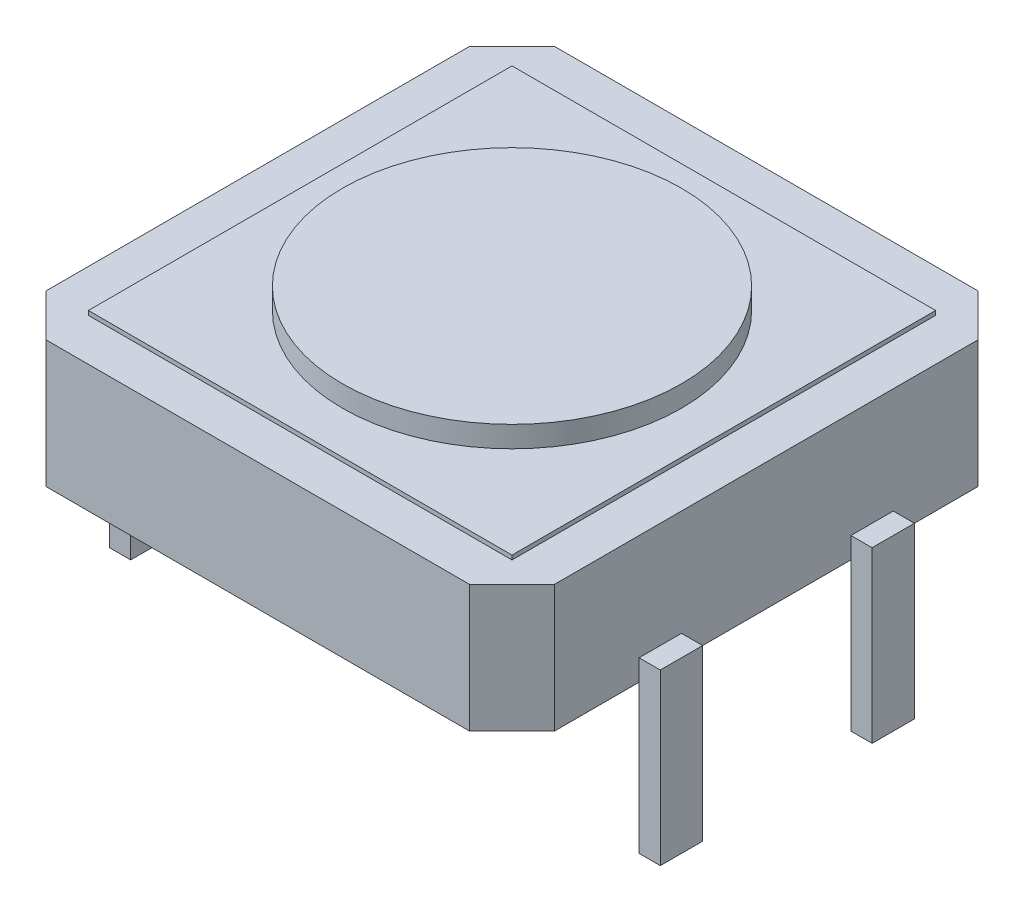
ISO-10303-21;
HEADER;
FILE_DESCRIPTION(('STEP AP214'),'2;1');
FILE_NAME('part.step','',(''),(''),'','','');
FILE_SCHEMA(('AUTOMOTIVE_DESIGN { 1 0 10303 214 1 1 1 1 }'));
ENDSEC;
DATA;
#1=APPLICATION_CONTEXT('core data for automotive mechanical design processes');
#2=APPLICATION_PROTOCOL_DEFINITION('international standard','automotive_design',2000,#1);
#3=PRODUCT_CONTEXT('',#1,'mechanical');
#4=PRODUCT('Part','Part','',(#3));
#5=PRODUCT_RELATED_PRODUCT_CATEGORY('part','',(#4));
#6=PRODUCT_DEFINITION_FORMATION('','',#4);
#7=PRODUCT_DEFINITION_CONTEXT('part definition',#1,'design');
#8=PRODUCT_DEFINITION('design','',#6,#7);
#9=PRODUCT_DEFINITION_SHAPE('','',#8);
#10=(LENGTH_UNIT() NAMED_UNIT(*) SI_UNIT(.MILLI.,.METRE.));
#11=(NAMED_UNIT(*) PLANE_ANGLE_UNIT() SI_UNIT($,.RADIAN.));
#12=(NAMED_UNIT(*) SI_UNIT($,.STERADIAN.) SOLID_ANGLE_UNIT());
#13=UNCERTAINTY_MEASURE_WITH_UNIT(LENGTH_MEASURE(1.E-05),#10,'distance_accuracy_value','');
#14=(GEOMETRIC_REPRESENTATION_CONTEXT(3) GLOBAL_UNCERTAINTY_ASSIGNED_CONTEXT((#13)) GLOBAL_UNIT_ASSIGNED_CONTEXT((#10,
#11,#12)) REPRESENTATION_CONTEXT('',''));
#15=CARTESIAN_POINT('',(0.,0.,0.));
#16=DIRECTION('',(0.,0.,1.));
#17=DIRECTION('',(1.,0.,0.));
#18=AXIS2_PLACEMENT_3D('',#15,#16,#17);
#19=CARTESIAN_POINT('',(12.,3.,-1.));
#20=DIRECTION('',(-1.,0.,0.));
#21=DIRECTION('',(0.,0.,1.));
#22=AXIS2_PLACEMENT_3D('',#19,#20,#21);
#23=PLANE('',#22);
#24=DIRECTION('',(0.,-1.,0.));
#25=VECTOR('',#24,1.);
#26=CARTESIAN_POINT('',(12.,0.5,-3.));
#27=LINE('',#26,#25);
#28=CARTESIAN_POINT('',(12.,0.5,-3.));
#29=VERTEX_POINT('',#28);
#30=CARTESIAN_POINT('',(12.,0.,-3.));
#31=VERTEX_POINT('',#30);
#32=EDGE_CURVE('E53',#29,#31,#27,.T.);
#33=ORIENTED_EDGE('',*,*,#32,.F.);
#34=DIRECTION('',(0.,0.,1.));
#35=VECTOR('',#34,1.);
#36=CARTESIAN_POINT('',(12.,0.5,-3.));
#37=LINE('',#36,#35);
#38=CARTESIAN_POINT('',(12.,0.5,-4.));
#39=VERTEX_POINT('',#38);
#40=EDGE_CURVE('E57',#39,#29,#37,.T.);
#41=ORIENTED_EDGE('',*,*,#40,.F.);
#42=DIRECTION('',(0.,1.,0.));
#43=VECTOR('',#42,1.);
#44=CARTESIAN_POINT('',(12.,0.5,-4.));
#45=LINE('',#44,#43);
#46=CARTESIAN_POINT('',(12.,0.,-4.));
#47=VERTEX_POINT('',#46);
#48=EDGE_CURVE('E939',#47,#39,#45,.T.);
#49=ORIENTED_EDGE('',*,*,#48,.F.);
#50=DIRECTION('',(0.,0.,-1.));
#51=VECTOR('',#50,1.);
#52=CARTESIAN_POINT('',(12.,0.,-1.));
#53=LINE('',#52,#51);
#54=CARTESIAN_POINT('',(12.,0.,-8.));
#55=VERTEX_POINT('',#54);
#56=EDGE_CURVE('E445',#47,#55,#53,.T.);
#57=ORIENTED_EDGE('',*,*,#56,.T.);
#58=DIRECTION('',(0.,-1.,0.));
#59=VECTOR('',#58,1.);
#60=CARTESIAN_POINT('',(12.,0.5,-8.));
#61=LINE('',#60,#59);
#62=CARTESIAN_POINT('',(12.,0.5,-8.));
#63=VERTEX_POINT('',#62);
#64=EDGE_CURVE('E322',#63,#55,#61,.T.);
#65=ORIENTED_EDGE('',*,*,#64,.F.);
#66=DIRECTION('',(0.,0.,1.));
#67=VECTOR('',#66,1.);
#68=CARTESIAN_POINT('',(12.,0.5,-8.));
#69=LINE('',#68,#67);
#70=CARTESIAN_POINT('',(12.,0.5,-9.));
#71=VERTEX_POINT('',#70);
#72=EDGE_CURVE('E315',#71,#63,#69,.T.);
#73=ORIENTED_EDGE('',*,*,#72,.F.);
#74=DIRECTION('',(0.,1.,0.));
#75=VECTOR('',#74,1.);
#76=CARTESIAN_POINT('',(12.,0.5,-9.));
#77=LINE('',#76,#75);
#78=CARTESIAN_POINT('',(12.,0.,-9.));
#79=VERTEX_POINT('',#78);
#80=EDGE_CURVE('E11',#79,#71,#77,.T.);
#81=ORIENTED_EDGE('',*,*,#80,.F.);
#82=CARTESIAN_POINT('',(12.,0.,-11.));
#83=VERTEX_POINT('',#82);
#84=EDGE_CURVE('E440',#79,#83,#53,.T.);
#85=ORIENTED_EDGE('',*,*,#84,.T.);
#86=DIRECTION('',(0.,-1.,0.));
#87=VECTOR('',#86,1.);
#88=CARTESIAN_POINT('',(12.,3.,-11.));
#89=LINE('',#88,#87);
#90=CARTESIAN_POINT('',(12.,3.,-11.));
#91=VERTEX_POINT('',#90);
#92=EDGE_CURVE('E459',#91,#83,#89,.T.);
#93=ORIENTED_EDGE('',*,*,#92,.F.);
#94=DIRECTION('',(0.,0.,-1.));
#95=VECTOR('',#94,1.);
#96=CARTESIAN_POINT('',(12.,3.,-1.));
#97=LINE('',#96,#95);
#98=CARTESIAN_POINT('',(12.,3.,-1.));
#99=VERTEX_POINT('',#98);
#100=EDGE_CURVE('E421',#99,#91,#97,.T.);
#101=ORIENTED_EDGE('',*,*,#100,.F.);
#102=DIRECTION('',(0.,-1.,0.));
#103=VECTOR('',#102,1.);
#104=CARTESIAN_POINT('',(12.,3.,-1.));
#105=LINE('',#104,#103);
#106=CARTESIAN_POINT('',(12.,0.,-1.));
#107=VERTEX_POINT('',#106);
#108=EDGE_CURVE('E462',#99,#107,#105,.T.);
#109=ORIENTED_EDGE('',*,*,#108,.T.);
#110=EDGE_CURVE('E441',#107,#31,#53,.T.);
#111=ORIENTED_EDGE('',*,*,#110,.T.);
#112=EDGE_LOOP('',(#33,#41,#49,#57,#65,#73,#81,#85,#93,#101,#109,#111));
#113=FACE_BOUND('',#112,.T.);
#114=ADVANCED_FACE('F35',(#113),#23,.F.);
#115=CARTESIAN_POINT('',(0.,3.,-1.));
#116=DIRECTION('',(1.,0.,0.));
#117=DIRECTION('',(0.,0.,-1.));
#118=AXIS2_PLACEMENT_3D('',#115,#116,#117);
#119=PLANE('',#118);
#120=DIRECTION('',(0.,-1.,0.));
#121=VECTOR('',#120,1.);
#122=CARTESIAN_POINT('',(0.,0.5,-4.));
#123=LINE('',#122,#121);
#124=CARTESIAN_POINT('',(0.,0.5,-4.));
#125=VERTEX_POINT('',#124);
#126=CARTESIAN_POINT('',(0.,0.,-4.));
#127=VERTEX_POINT('',#126);
#128=EDGE_CURVE('E273',#125,#127,#123,.T.);
#129=ORIENTED_EDGE('',*,*,#128,.F.);
#130=DIRECTION('',(0.,0.,-1.));
#131=VECTOR('',#130,1.);
#132=CARTESIAN_POINT('',(0.,0.5,-4.));
#133=LINE('',#132,#131);
#134=CARTESIAN_POINT('',(0.,0.5,-3.));
#135=VERTEX_POINT('',#134);
#136=EDGE_CURVE('E283',#135,#125,#133,.T.);
#137=ORIENTED_EDGE('',*,*,#136,.F.);
#138=DIRECTION('',(0.,1.,0.));
#139=VECTOR('',#138,1.);
#140=CARTESIAN_POINT('',(0.,0.5,-3.));
#141=LINE('',#140,#139);
#142=CARTESIAN_POINT('',(0.,0.,-3.));
#143=VERTEX_POINT('',#142);
#144=EDGE_CURVE('E293',#143,#135,#141,.T.);
#145=ORIENTED_EDGE('',*,*,#144,.F.);
#146=DIRECTION('',(0.,0.,1.));
#147=VECTOR('',#146,1.);
#148=CARTESIAN_POINT('',(0.,0.,-1.));
#149=LINE('',#148,#147);
#150=CARTESIAN_POINT('',(0.,0.,-1.));
#151=VERTEX_POINT('',#150);
#152=EDGE_CURVE('E410',#143,#151,#149,.T.);
#153=ORIENTED_EDGE('',*,*,#152,.T.);
#154=DIRECTION('',(0.,-1.,0.));
#155=VECTOR('',#154,1.);
#156=CARTESIAN_POINT('',(0.,3.,-1.));
#157=LINE('',#156,#155);
#158=CARTESIAN_POINT('',(0.,3.,-1.));
#159=VERTEX_POINT('',#158);
#160=EDGE_CURVE('E470',#159,#151,#157,.T.);
#161=ORIENTED_EDGE('',*,*,#160,.F.);
#162=DIRECTION('',(0.,0.,1.));
#163=VECTOR('',#162,1.);
#164=CARTESIAN_POINT('',(0.,3.,-1.));
#165=LINE('',#164,#163);
#166=CARTESIAN_POINT('',(0.,3.,-11.));
#167=VERTEX_POINT('',#166);
#168=EDGE_CURVE('E411',#167,#159,#165,.T.);
#169=ORIENTED_EDGE('',*,*,#168,.F.);
#170=DIRECTION('',(0.,-1.,0.));
#171=VECTOR('',#170,1.);
#172=CARTESIAN_POINT('',(0.,3.,-11.));
#173=LINE('',#172,#171);
#174=CARTESIAN_POINT('',(0.,0.,-11.));
#175=VERTEX_POINT('',#174);
#176=EDGE_CURVE('E429',#167,#175,#173,.T.);
#177=ORIENTED_EDGE('',*,*,#176,.T.);
#178=CARTESIAN_POINT('',(0.,0.,-9.));
#179=VERTEX_POINT('',#178);
#180=EDGE_CURVE('E430',#175,#179,#149,.T.);
#181=ORIENTED_EDGE('',*,*,#180,.T.);
#182=DIRECTION('',(0.,-1.,0.));
#183=VECTOR('',#182,1.);
#184=CARTESIAN_POINT('',(0.,0.5,-9.));
#185=LINE('',#184,#183);
#186=CARTESIAN_POINT('',(0.,0.5,-9.));
#187=VERTEX_POINT('',#186);
#188=EDGE_CURVE('E353',#187,#179,#185,.T.);
#189=ORIENTED_EDGE('',*,*,#188,.F.);
#190=DIRECTION('',(0.,0.,-1.));
#191=VECTOR('',#190,1.);
#192=CARTESIAN_POINT('',(0.,0.5,-9.));
#193=LINE('',#192,#191);
#194=CARTESIAN_POINT('',(0.,0.5,-8.));
#195=VERTEX_POINT('',#194);
#196=EDGE_CURVE('E346',#195,#187,#193,.T.);
#197=ORIENTED_EDGE('',*,*,#196,.F.);
#198=DIRECTION('',(0.,1.,0.));
#199=VECTOR('',#198,1.);
#200=CARTESIAN_POINT('',(0.,0.5,-8.));
#201=LINE('',#200,#199);
#202=CARTESIAN_POINT('',(0.,0.,-8.));
#203=VERTEX_POINT('',#202);
#204=EDGE_CURVE('E44',#203,#195,#201,.T.);
#205=ORIENTED_EDGE('',*,*,#204,.F.);
#206=EDGE_CURVE('E503',#203,#127,#149,.T.);
#207=ORIENTED_EDGE('',*,*,#206,.T.);
#208=EDGE_LOOP('',(#129,#137,#145,#153,#161,#169,#177,#181,#189,#197,#205,#207));
#209=FACE_BOUND('',#208,.T.);
#210=ADVANCED_FACE('F37',(#209),#119,.F.);
#211=CARTESIAN_POINT('',(0.,3.1,0.));
#212=DIRECTION('',(0.,-1.,0.));
#213=DIRECTION('',(0.,0.,-1.));
#214=AXIS2_PLACEMENT_3D('',#211,#212,#213);
#215=PLANE('',#214);
#216=DIRECTION('',(0.,0.,1.));
#217=VECTOR('',#216,1.);
#218=CARTESIAN_POINT('',(1.,3.1,-1.));
#219=LINE('',#218,#217);
#220=CARTESIAN_POINT('',(1.,3.1,-11.));
#221=VERTEX_POINT('',#220);
#222=CARTESIAN_POINT('',(1.,3.1,-1.));
#223=VERTEX_POINT('',#222);
#224=EDGE_CURVE('E378',#221,#223,#219,.T.);
#225=ORIENTED_EDGE('',*,*,#224,.T.);
#226=DIRECTION('',(1.,0.,0.));
#227=VECTOR('',#226,1.);
#228=CARTESIAN_POINT('',(1.,3.1,-1.));
#229=LINE('',#228,#227);
#230=CARTESIAN_POINT('',(11.,3.1,-1.));
#231=VERTEX_POINT('',#230);
#232=EDGE_CURVE('E381',#223,#231,#229,.T.);
#233=ORIENTED_EDGE('',*,*,#232,.T.);
#234=DIRECTION('',(0.,0.,-1.));
#235=VECTOR('',#234,1.);
#236=CARTESIAN_POINT('',(11.,3.1,-1.));
#237=LINE('',#236,#235);
#238=CARTESIAN_POINT('',(11.,3.1,-11.));
#239=VERTEX_POINT('',#238);
#240=EDGE_CURVE('E384',#231,#239,#237,.T.);
#241=ORIENTED_EDGE('',*,*,#240,.T.);
#242=DIRECTION('',(-1.,0.,0.));
#243=VECTOR('',#242,1.);
#244=CARTESIAN_POINT('',(1.,3.1,-11.));
#245=LINE('',#244,#243);
#246=EDGE_CURVE('E386',#239,#221,#245,.T.);
#247=ORIENTED_EDGE('',*,*,#246,.T.);
#248=EDGE_LOOP('',(#225,#233,#241,#247));
#249=FACE_BOUND('',#248,.T.);
#250=CARTESIAN_POINT('',(6.,3.1,-6.));
#251=DIRECTION('',(0.,-1.,0.));
#252=DIRECTION('',(0.,0.,-1.));
#253=AXIS2_PLACEMENT_3D('',#250,#251,#252);
#254=CIRCLE('',#253,4.);
#255=CARTESIAN_POINT('',(6.,3.1,-10.));
#256=VERTEX_POINT('',#255);
#257=EDGE_CURVE('E39',#256,#256,#254,.F.);
#258=ORIENTED_EDGE('',*,*,#257,.F.);
#259=EDGE_LOOP('',(#258));
#260=FACE_BOUND('',#259,.T.);
#261=ADVANCED_FACE('F585',(#249,#260),#215,.F.);
#262=CARTESIAN_POINT('',(0.,3.,0.));
#263=DIRECTION('',(0.,-1.,0.));
#264=DIRECTION('',(0.,0.,-1.));
#265=AXIS2_PLACEMENT_3D('',#262,#263,#264);
#266=PLANE('',#265);
#267=ORIENTED_EDGE('',*,*,#168,.T.);
#268=DIRECTION('',(0.707106781186548,0.,0.707106781186548));
#269=VECTOR('',#268,1.);
#270=CARTESIAN_POINT('',(0.,3.,-1.));
#271=LINE('',#270,#269);
#272=CARTESIAN_POINT('',(1.,3.,0.));
#273=VERTEX_POINT('',#272);
#274=EDGE_CURVE('E414',#159,#273,#271,.T.);
#275=ORIENTED_EDGE('',*,*,#274,.T.);
#276=DIRECTION('',(1.,0.,0.));
#277=VECTOR('',#276,1.);
#278=CARTESIAN_POINT('',(1.,3.,0.));
#279=LINE('',#278,#277);
#280=CARTESIAN_POINT('',(11.,3.,0.));
#281=VERTEX_POINT('',#280);
#282=EDGE_CURVE('E417',#273,#281,#279,.T.);
#283=ORIENTED_EDGE('',*,*,#282,.T.);
#284=DIRECTION('',(0.707106781186548,0.,-0.707106781186547));
#285=VECTOR('',#284,1.);
#286=CARTESIAN_POINT('',(11.,3.,0.));
#287=LINE('',#286,#285);
#288=EDGE_CURVE('E419',#281,#99,#287,.T.);
#289=ORIENTED_EDGE('',*,*,#288,.T.);
#290=ORIENTED_EDGE('',*,*,#100,.T.);
#291=DIRECTION('',(-0.707106781186547,0.,-0.707106781186547));
#292=VECTOR('',#291,1.);
#293=CARTESIAN_POINT('',(11.,3.,-12.));
#294=LINE('',#293,#292);
#295=CARTESIAN_POINT('',(11.,3.,-12.));
#296=VERTEX_POINT('',#295);
#297=EDGE_CURVE('E423',#91,#296,#294,.T.);
#298=ORIENTED_EDGE('',*,*,#297,.T.);
#299=DIRECTION('',(-1.,0.,0.));
#300=VECTOR('',#299,1.);
#301=CARTESIAN_POINT('',(1.,3.,-12.));
#302=LINE('',#301,#300);
#303=CARTESIAN_POINT('',(1.,3.,-12.));
#304=VERTEX_POINT('',#303);
#305=EDGE_CURVE('E425',#296,#304,#302,.T.);
#306=ORIENTED_EDGE('',*,*,#305,.T.);
#307=DIRECTION('',(-0.707106781186547,0.,0.707106781186548));
#308=VECTOR('',#307,1.);
#309=CARTESIAN_POINT('',(0.,3.,-11.));
#310=LINE('',#309,#308);
#311=EDGE_CURVE('E427',#304,#167,#310,.T.);
#312=ORIENTED_EDGE('',*,*,#311,.T.);
#313=EDGE_LOOP('',(#267,#275,#283,#289,#290,#298,#306,#312));
#314=FACE_BOUND('',#313,.T.);
#315=DIRECTION('',(0.,0.,1.));
#316=VECTOR('',#315,1.);
#317=CARTESIAN_POINT('',(1.,3.,-1.));
#318=LINE('',#317,#316);
#319=CARTESIAN_POINT('',(1.,3.,-11.));
#320=VERTEX_POINT('',#319);
#321=CARTESIAN_POINT('',(1.,3.,-1.));
#322=VERTEX_POINT('',#321);
#323=EDGE_CURVE('E377',#320,#322,#318,.T.);
#324=ORIENTED_EDGE('',*,*,#323,.F.);
#325=DIRECTION('',(-1.,0.,0.));
#326=VECTOR('',#325,1.);
#327=CARTESIAN_POINT('',(1.,3.,-11.));
#328=LINE('',#327,#326);
#329=CARTESIAN_POINT('',(11.,3.,-11.));
#330=VERTEX_POINT('',#329);
#331=EDGE_CURVE('E382',#330,#320,#328,.T.);
#332=ORIENTED_EDGE('',*,*,#331,.F.);
#333=DIRECTION('',(0.,0.,-1.));
#334=VECTOR('',#333,1.);
#335=CARTESIAN_POINT('',(11.,3.,-1.));
#336=LINE('',#335,#334);
#337=CARTESIAN_POINT('',(11.,3.,-1.));
#338=VERTEX_POINT('',#337);
#339=EDGE_CURVE('E394',#338,#330,#336,.T.);
#340=ORIENTED_EDGE('',*,*,#339,.F.);
#341=DIRECTION('',(1.,0.,0.));
#342=VECTOR('',#341,1.);
#343=CARTESIAN_POINT('',(1.,3.,-1.));
#344=LINE('',#343,#342);
#345=EDGE_CURVE('E391',#322,#338,#344,.T.);
#346=ORIENTED_EDGE('',*,*,#345,.F.);
#347=EDGE_LOOP('',(#324,#332,#340,#346));
#348=FACE_BOUND('',#347,.T.);
#349=ADVANCED_FACE('F524',(#314,#348),#266,.F.);
#350=CARTESIAN_POINT('',(0.,3.,-1.));
#351=DIRECTION('',(0.707106781186547,0.,-0.707106781186547));
#352=DIRECTION('',(-0.707106781186548,0.,-0.707106781186548));
#353=AXIS2_PLACEMENT_3D('',#350,#351,#352);
#354=PLANE('',#353);
#355=DIRECTION('',(0.707106781186548,0.,0.707106781186548));
#356=VECTOR('',#355,1.);
#357=CARTESIAN_POINT('',(0.,0.,-1.));
#358=LINE('',#357,#356);
#359=CARTESIAN_POINT('',(1.,0.,0.));
#360=VERTEX_POINT('',#359);
#361=EDGE_CURVE('E433',#151,#360,#358,.T.);
#362=ORIENTED_EDGE('',*,*,#361,.T.);
#363=DIRECTION('',(0.,-1.,0.));
#364=VECTOR('',#363,1.);
#365=CARTESIAN_POINT('',(1.,3.,0.));
#366=LINE('',#365,#364);
#367=EDGE_CURVE('E468',#273,#360,#366,.T.);
#368=ORIENTED_EDGE('',*,*,#367,.F.);
#369=ORIENTED_EDGE('',*,*,#274,.F.);
#370=ORIENTED_EDGE('',*,*,#160,.T.);
#371=EDGE_LOOP('',(#362,#368,#369,#370));
#372=FACE_BOUND('',#371,.T.);
#373=ADVANCED_FACE('F517',(#372),#354,.F.);
#374=CARTESIAN_POINT('',(1.,3.,0.));
#375=DIRECTION('',(0.,0.,-1.));
#376=DIRECTION('',(-1.,0.,0.));
#377=AXIS2_PLACEMENT_3D('',#374,#375,#376);
#378=PLANE('',#377);
#379=DIRECTION('',(1.,0.,0.));
#380=VECTOR('',#379,1.);
#381=CARTESIAN_POINT('',(1.,0.,0.));
#382=LINE('',#381,#380);
#383=CARTESIAN_POINT('',(11.,0.,0.));
#384=VERTEX_POINT('',#383);
#385=EDGE_CURVE('E436',#360,#384,#382,.T.);
#386=ORIENTED_EDGE('',*,*,#385,.T.);
#387=DIRECTION('',(0.,-1.,0.));
#388=VECTOR('',#387,1.);
#389=CARTESIAN_POINT('',(11.,3.,0.));
#390=LINE('',#389,#388);
#391=EDGE_CURVE('E465',#281,#384,#390,.T.);
#392=ORIENTED_EDGE('',*,*,#391,.F.);
#393=ORIENTED_EDGE('',*,*,#282,.F.);
#394=ORIENTED_EDGE('',*,*,#367,.T.);
#395=EDGE_LOOP('',(#386,#392,#393,#394));
#396=FACE_BOUND('',#395,.T.);
#397=ADVANCED_FACE('F520',(#396),#378,.F.);
#398=CARTESIAN_POINT('',(11.,3.,0.));
#399=DIRECTION('',(-0.707106781186547,0.,-0.707106781186548));
#400=DIRECTION('',(-0.707106781186548,0.,0.707106781186547));
#401=AXIS2_PLACEMENT_3D('',#398,#399,#400);
#402=PLANE('',#401);
#403=DIRECTION('',(0.707106781186548,0.,-0.707106781186547));
#404=VECTOR('',#403,1.);
#405=CARTESIAN_POINT('',(11.,0.,0.));
#406=LINE('',#405,#404);
#407=EDGE_CURVE('E438',#384,#107,#406,.T.);
#408=ORIENTED_EDGE('',*,*,#407,.T.);
#409=ORIENTED_EDGE('',*,*,#108,.F.);
#410=ORIENTED_EDGE('',*,*,#288,.F.);
#411=ORIENTED_EDGE('',*,*,#391,.T.);
#412=EDGE_LOOP('',(#408,#409,#410,#411));
#413=FACE_BOUND('',#412,.T.);
#414=ADVANCED_FACE('F589',(#413),#402,.F.);
#415=CARTESIAN_POINT('',(11.,3.,-12.));
#416=DIRECTION('',(-0.707106781186548,0.,0.707106781186548));
#417=DIRECTION('',(0.707106781186548,0.,0.707106781186548));
#418=AXIS2_PLACEMENT_3D('',#415,#416,#417);
#419=PLANE('',#418);
#420=DIRECTION('',(-0.707106781186547,0.,-0.707106781186547));
#421=VECTOR('',#420,1.);
#422=CARTESIAN_POINT('',(11.,0.,-12.));
#423=LINE('',#422,#421);
#424=CARTESIAN_POINT('',(11.,0.,-12.));
#425=VERTEX_POINT('',#424);
#426=EDGE_CURVE('E443',#83,#425,#423,.T.);
#427=ORIENTED_EDGE('',*,*,#426,.T.);
#428=DIRECTION('',(0.,-1.,0.));
#429=VECTOR('',#428,1.);
#430=CARTESIAN_POINT('',(11.,3.,-12.));
#431=LINE('',#430,#429);
#432=EDGE_CURVE('E456',#296,#425,#431,.T.);
#433=ORIENTED_EDGE('',*,*,#432,.F.);
#434=ORIENTED_EDGE('',*,*,#297,.F.);
#435=ORIENTED_EDGE('',*,*,#92,.T.);
#436=EDGE_LOOP('',(#427,#433,#434,#435));
#437=FACE_BOUND('',#436,.T.);
#438=ADVANCED_FACE('F541',(#437),#419,.F.);
#439=CARTESIAN_POINT('',(1.,3.,-12.));
#440=DIRECTION('',(0.,0.,1.));
#441=DIRECTION('',(1.,0.,0.));
#442=AXIS2_PLACEMENT_3D('',#439,#440,#441);
#443=PLANE('',#442);
#444=DIRECTION('',(-1.,0.,0.));
#445=VECTOR('',#444,1.);
#446=CARTESIAN_POINT('',(1.,0.,-12.));
#447=LINE('',#446,#445);
#448=CARTESIAN_POINT('',(1.,0.,-12.));
#449=VERTEX_POINT('',#448);
#450=EDGE_CURVE('E448',#425,#449,#447,.T.);
#451=ORIENTED_EDGE('',*,*,#450,.T.);
#452=DIRECTION('',(0.,-1.,0.));
#453=VECTOR('',#452,1.);
#454=CARTESIAN_POINT('',(1.,3.,-12.));
#455=LINE('',#454,#453);
#456=EDGE_CURVE('E453',#304,#449,#455,.T.);
#457=ORIENTED_EDGE('',*,*,#456,.F.);
#458=ORIENTED_EDGE('',*,*,#305,.F.);
#459=ORIENTED_EDGE('',*,*,#432,.T.);
#460=EDGE_LOOP('',(#451,#457,#458,#459));
#461=FACE_BOUND('',#460,.T.);
#462=ADVANCED_FACE('F537',(#461),#443,.F.);
#463=CARTESIAN_POINT('',(0.,3.,-11.));
#464=DIRECTION('',(0.707106781186548,0.,0.707106781186547));
#465=DIRECTION('',(0.707106781186547,0.,-0.707106781186548));
#466=AXIS2_PLACEMENT_3D('',#463,#464,#465);
#467=PLANE('',#466);
#468=DIRECTION('',(-0.707106781186547,0.,0.707106781186548));
#469=VECTOR('',#468,1.);
#470=CARTESIAN_POINT('',(0.,0.,-11.));
#471=LINE('',#470,#469);
#472=EDGE_CURVE('E415',#449,#175,#471,.T.);
#473=ORIENTED_EDGE('',*,*,#472,.T.);
#474=ORIENTED_EDGE('',*,*,#176,.F.);
#475=ORIENTED_EDGE('',*,*,#311,.F.);
#476=ORIENTED_EDGE('',*,*,#456,.T.);
#477=EDGE_LOOP('',(#473,#474,#475,#476));
#478=FACE_BOUND('',#477,.T.);
#479=ADVANCED_FACE('F533',(#478),#467,.F.);
#480=CARTESIAN_POINT('',(0.,0.,0.));
#481=DIRECTION('',(0.,-1.,0.));
#482=DIRECTION('',(0.,0.,-1.));
#483=AXIS2_PLACEMENT_3D('',#480,#481,#482);
#484=PLANE('',#483);
#485=ORIENTED_EDGE('',*,*,#180,.F.);
#486=ORIENTED_EDGE('',*,*,#472,.F.);
#487=ORIENTED_EDGE('',*,*,#450,.F.);
#488=ORIENTED_EDGE('',*,*,#426,.F.);
#489=ORIENTED_EDGE('',*,*,#84,.F.);
#490=EDGE_CURVE('E446',#55,#79,#53,.T.);
#491=ORIENTED_EDGE('',*,*,#490,.F.);
#492=ORIENTED_EDGE('',*,*,#56,.F.);
#493=EDGE_CURVE('E444',#31,#47,#53,.T.);
#494=ORIENTED_EDGE('',*,*,#493,.F.);
#495=ORIENTED_EDGE('',*,*,#110,.F.);
#496=ORIENTED_EDGE('',*,*,#407,.F.);
#497=ORIENTED_EDGE('',*,*,#385,.F.);
#498=ORIENTED_EDGE('',*,*,#361,.F.);
#499=ORIENTED_EDGE('',*,*,#152,.F.);
#500=EDGE_CURVE('E504',#127,#143,#149,.T.);
#501=ORIENTED_EDGE('',*,*,#500,.F.);
#502=ORIENTED_EDGE('',*,*,#206,.F.);
#503=EDGE_CURVE('E434',#179,#203,#149,.T.);
#504=ORIENTED_EDGE('',*,*,#503,.F.);
#505=EDGE_LOOP('',(#485,#486,#487,#488,#489,#491,#492,#494,#495,#496,#497,#498,#499,#501,#502,#504));
#506=FACE_BOUND('',#505,.T.);
#507=ADVANCED_FACE('F514',(#506),#484,.T.);
#508=CARTESIAN_POINT('',(1.,3.1,-1.));
#509=DIRECTION('',(1.,0.,0.));
#510=DIRECTION('',(0.,0.,-1.));
#511=AXIS2_PLACEMENT_3D('',#508,#509,#510);
#512=PLANE('',#511);
#513=ORIENTED_EDGE('',*,*,#323,.T.);
#514=DIRECTION('',(0.,-1.,0.));
#515=VECTOR('',#514,1.);
#516=CARTESIAN_POINT('',(1.,3.1,-1.));
#517=LINE('',#516,#515);
#518=EDGE_CURVE('E407',#223,#322,#517,.T.);
#519=ORIENTED_EDGE('',*,*,#518,.F.);
#520=ORIENTED_EDGE('',*,*,#224,.F.);
#521=DIRECTION('',(0.,-1.,0.));
#522=VECTOR('',#521,1.);
#523=CARTESIAN_POINT('',(1.,3.1,-11.));
#524=LINE('',#523,#522);
#525=EDGE_CURVE('E388',#221,#320,#524,.T.);
#526=ORIENTED_EDGE('',*,*,#525,.T.);
#527=EDGE_LOOP('',(#513,#519,#520,#526));
#528=FACE_BOUND('',#527,.T.);
#529=ADVANCED_FACE('F606',(#528),#512,.F.);
#530=CARTESIAN_POINT('',(1.,3.1,-1.));
#531=DIRECTION('',(0.,0.,-1.));
#532=DIRECTION('',(-1.,0.,0.));
#533=AXIS2_PLACEMENT_3D('',#530,#531,#532);
#534=PLANE('',#533);
#535=ORIENTED_EDGE('',*,*,#345,.T.);
#536=DIRECTION('',(0.,-1.,0.));
#537=VECTOR('',#536,1.);
#538=CARTESIAN_POINT('',(11.,3.1,-1.));
#539=LINE('',#538,#537);
#540=EDGE_CURVE('E404',#231,#338,#539,.T.);
#541=ORIENTED_EDGE('',*,*,#540,.F.);
#542=ORIENTED_EDGE('',*,*,#232,.F.);
#543=ORIENTED_EDGE('',*,*,#518,.T.);
#544=EDGE_LOOP('',(#535,#541,#542,#543));
#545=FACE_BOUND('',#544,.T.);
#546=ADVANCED_FACE('F663',(#545),#534,.F.);
#547=CARTESIAN_POINT('',(11.,3.1,-1.));
#548=DIRECTION('',(-1.,0.,0.));
#549=DIRECTION('',(0.,0.,1.));
#550=AXIS2_PLACEMENT_3D('',#547,#548,#549);
#551=PLANE('',#550);
#552=ORIENTED_EDGE('',*,*,#339,.T.);
#553=DIRECTION('',(0.,-1.,0.));
#554=VECTOR('',#553,1.);
#555=CARTESIAN_POINT('',(11.,3.1,-11.));
#556=LINE('',#555,#554);
#557=EDGE_CURVE('E401',#239,#330,#556,.T.);
#558=ORIENTED_EDGE('',*,*,#557,.F.);
#559=ORIENTED_EDGE('',*,*,#240,.F.);
#560=ORIENTED_EDGE('',*,*,#540,.T.);
#561=EDGE_LOOP('',(#552,#558,#559,#560));
#562=FACE_BOUND('',#561,.T.);
#563=ADVANCED_FACE('F671',(#562),#551,.F.);
#564=CARTESIAN_POINT('',(1.,3.1,-11.));
#565=DIRECTION('',(0.,0.,1.));
#566=DIRECTION('',(1.,0.,0.));
#567=AXIS2_PLACEMENT_3D('',#564,#565,#566);
#568=PLANE('',#567);
#569=ORIENTED_EDGE('',*,*,#331,.T.);
#570=ORIENTED_EDGE('',*,*,#525,.F.);
#571=ORIENTED_EDGE('',*,*,#246,.F.);
#572=ORIENTED_EDGE('',*,*,#557,.T.);
#573=EDGE_LOOP('',(#569,#570,#571,#572));
#574=FACE_BOUND('',#573,.T.);
#575=ADVANCED_FACE('F679',(#574),#568,.F.);
#576=CARTESIAN_POINT('',(6.,3.6,-6.));
#577=DIRECTION('',(0.,-1.,0.));
#578=DIRECTION('',(0.,0.,-1.));
#579=AXIS2_PLACEMENT_3D('',#576,#577,#578);
#580=CYLINDRICAL_SURFACE('',#579,4.);
#581=CARTESIAN_POINT('',(6.,3.6,-6.));
#582=DIRECTION('',(0.,1.,0.));
#583=DIRECTION('',(0.,0.,1.));
#584=AXIS2_PLACEMENT_3D('',#581,#582,#583);
#585=CIRCLE('',#584,4.);
#586=CARTESIAN_POINT('',(6.,3.6,-2.));
#587=VERTEX_POINT('',#586);
#588=EDGE_CURVE('E374',#587,#587,#585,.T.);
#589=ORIENTED_EDGE('',*,*,#588,.F.);
#590=EDGE_LOOP('',(#589));
#591=FACE_BOUND('',#590,.T.);
#592=ORIENTED_EDGE('',*,*,#257,.T.);
#593=EDGE_LOOP('',(#592));
#594=FACE_BOUND('',#593,.T.);
#595=ADVANCED_FACE('F688',(#591,#594),#580,.T.);
#596=CARTESIAN_POINT('',(6.,3.6,-6.));
#597=DIRECTION('',(0.,1.,0.));
#598=DIRECTION('',(0.,0.,1.));
#599=AXIS2_PLACEMENT_3D('',#596,#597,#598);
#600=PLANE('',#599);
#601=ORIENTED_EDGE('',*,*,#588,.T.);
#602=EDGE_LOOP('',(#601));
#603=FACE_BOUND('',#602,.T.);
#604=ADVANCED_FACE('F702',(#603),#600,.T.);
#605=CARTESIAN_POINT('',(0.,0.,0.));
#606=DIRECTION('',(-1.,0.,0.));
#607=DIRECTION('',(0.,0.,1.));
#608=AXIS2_PLACEMENT_3D('',#605,#606,#607);
#609=PLANE('',#608);
#610=CARTESIAN_POINT('',(0.,-3.5,-9.));
#611=VERTEX_POINT('',#610);
#612=EDGE_CURVE('E341',#179,#611,#185,.T.);
#613=ORIENTED_EDGE('',*,*,#612,.F.);
#614=ORIENTED_EDGE('',*,*,#503,.T.);
#615=CARTESIAN_POINT('',(0.,-3.5,-8.));
#616=VERTEX_POINT('',#615);
#617=EDGE_CURVE('E358',#616,#203,#201,.T.);
#618=ORIENTED_EDGE('',*,*,#617,.F.);
#619=DIRECTION('',(0.,0.,1.));
#620=VECTOR('',#619,1.);
#621=CARTESIAN_POINT('',(0.,-3.5,-9.));
#622=LINE('',#621,#620);
#623=EDGE_CURVE('E356',#611,#616,#622,.T.);
#624=ORIENTED_EDGE('',*,*,#623,.F.);
#625=EDGE_LOOP('',(#613,#614,#618,#624));
#626=FACE_BOUND('',#625,.T.);
#627=ADVANCED_FACE('F500',(#626),#609,.F.);
#628=CARTESIAN_POINT('',(-0.5,0.5,-9.));
#629=DIRECTION('',(0.,0.,1.));
#630=DIRECTION('',(1.,0.,0.));
#631=AXIS2_PLACEMENT_3D('',#628,#629,#630);
#632=PLANE('',#631);
#633=ORIENTED_EDGE('',*,*,#188,.T.);
#634=ORIENTED_EDGE('',*,*,#612,.T.);
#635=DIRECTION('',(1.,0.,0.));
#636=VECTOR('',#635,1.);
#637=CARTESIAN_POINT('',(-0.5,-3.5,-9.));
#638=LINE('',#637,#636);
#639=CARTESIAN_POINT('',(-0.5,-3.5,-9.));
#640=VERTEX_POINT('',#639);
#641=EDGE_CURVE('E371',#640,#611,#638,.T.);
#642=ORIENTED_EDGE('',*,*,#641,.F.);
#643=DIRECTION('',(0.,-1.,0.));
#644=VECTOR('',#643,1.);
#645=CARTESIAN_POINT('',(-0.5,0.5,-9.));
#646=LINE('',#645,#644);
#647=CARTESIAN_POINT('',(-0.5,0.5,-9.));
#648=VERTEX_POINT('',#647);
#649=EDGE_CURVE('E342',#648,#640,#646,.T.);
#650=ORIENTED_EDGE('',*,*,#649,.F.);
#651=DIRECTION('',(1.,0.,0.));
#652=VECTOR('',#651,1.);
#653=CARTESIAN_POINT('',(-0.5,0.5,-9.));
#654=LINE('',#653,#652);
#655=EDGE_CURVE('E352',#648,#187,#654,.T.);
#656=ORIENTED_EDGE('',*,*,#655,.T.);
#657=EDGE_LOOP('',(#633,#634,#642,#650,#656));
#658=FACE_BOUND('',#657,.T.);
#659=ADVANCED_FACE('F719',(#658),#632,.F.);
#660=CARTESIAN_POINT('',(-0.5,-3.5,-9.));
#661=DIRECTION('',(0.,1.,0.));
#662=DIRECTION('',(0.,0.,1.));
#663=AXIS2_PLACEMENT_3D('',#660,#661,#662);
#664=PLANE('',#663);
#665=ORIENTED_EDGE('',*,*,#623,.T.);
#666=DIRECTION('',(1.,0.,0.));
#667=VECTOR('',#666,1.);
#668=CARTESIAN_POINT('',(-0.5,-3.5,-8.));
#669=LINE('',#668,#667);
#670=CARTESIAN_POINT('',(-0.5,-3.5,-8.));
#671=VERTEX_POINT('',#670);
#672=EDGE_CURVE('E368',#671,#616,#669,.T.);
#673=ORIENTED_EDGE('',*,*,#672,.F.);
#674=DIRECTION('',(0.,0.,1.));
#675=VECTOR('',#674,1.);
#676=CARTESIAN_POINT('',(-0.5,-3.5,-9.));
#677=LINE('',#676,#675);
#678=EDGE_CURVE('E345',#640,#671,#677,.T.);
#679=ORIENTED_EDGE('',*,*,#678,.F.);
#680=ORIENTED_EDGE('',*,*,#641,.T.);
#681=EDGE_LOOP('',(#665,#673,#679,#680));
#682=FACE_BOUND('',#681,.T.);
#683=ADVANCED_FACE('F727',(#682),#664,.F.);
#684=CARTESIAN_POINT('',(-0.5,0.5,-8.));
#685=DIRECTION('',(0.,0.,-1.));
#686=DIRECTION('',(-1.,0.,0.));
#687=AXIS2_PLACEMENT_3D('',#684,#685,#686);
#688=PLANE('',#687);
#689=ORIENTED_EDGE('',*,*,#617,.T.);
#690=ORIENTED_EDGE('',*,*,#204,.T.);
#691=DIRECTION('',(1.,0.,0.));
#692=VECTOR('',#691,1.);
#693=CARTESIAN_POINT('',(-0.5,0.5,-8.));
#694=LINE('',#693,#692);
#695=CARTESIAN_POINT('',(-0.5,0.5,-8.));
#696=VERTEX_POINT('',#695);
#697=EDGE_CURVE('E365',#696,#195,#694,.T.);
#698=ORIENTED_EDGE('',*,*,#697,.F.);
#699=DIRECTION('',(0.,1.,0.));
#700=VECTOR('',#699,1.);
#701=CARTESIAN_POINT('',(-0.5,0.5,-8.));
#702=LINE('',#701,#700);
#703=EDGE_CURVE('E348',#671,#696,#702,.T.);
#704=ORIENTED_EDGE('',*,*,#703,.F.);
#705=ORIENTED_EDGE('',*,*,#672,.T.);
#706=EDGE_LOOP('',(#689,#690,#698,#704,#705));
#707=FACE_BOUND('',#706,.T.);
#708=ADVANCED_FACE('F480',(#707),#688,.F.);
#709=CARTESIAN_POINT('',(-0.5,0.5,-9.));
#710=DIRECTION('',(0.,-1.,0.));
#711=DIRECTION('',(0.,0.,-1.));
#712=AXIS2_PLACEMENT_3D('',#709,#710,#711);
#713=PLANE('',#712);
#714=ORIENTED_EDGE('',*,*,#196,.T.);
#715=ORIENTED_EDGE('',*,*,#655,.F.);
#716=DIRECTION('',(0.,0.,-1.));
#717=VECTOR('',#716,1.);
#718=CARTESIAN_POINT('',(-0.5,0.5,-9.));
#719=LINE('',#718,#717);
#720=EDGE_CURVE('E350',#696,#648,#719,.T.);
#721=ORIENTED_EDGE('',*,*,#720,.F.);
#722=ORIENTED_EDGE('',*,*,#697,.T.);
#723=EDGE_LOOP('',(#714,#715,#721,#722));
#724=FACE_BOUND('',#723,.T.);
#725=ADVANCED_FACE('F488',(#724),#713,.F.);
#726=CARTESIAN_POINT('',(-0.5,0.,0.));
#727=DIRECTION('',(-1.,0.,0.));
#728=DIRECTION('',(0.,0.,1.));
#729=AXIS2_PLACEMENT_3D('',#726,#727,#728);
#730=PLANE('',#729);
#731=ORIENTED_EDGE('',*,*,#649,.T.);
#732=ORIENTED_EDGE('',*,*,#678,.T.);
#733=ORIENTED_EDGE('',*,*,#703,.T.);
#734=ORIENTED_EDGE('',*,*,#720,.T.);
#735=EDGE_LOOP('',(#731,#732,#733,#734));
#736=FACE_BOUND('',#735,.T.);
#737=ADVANCED_FACE('F492',(#736),#730,.T.);
#738=CARTESIAN_POINT('',(12.,0.,0.));
#739=DIRECTION('',(1.,0.,0.));
#740=DIRECTION('',(0.,0.,-1.));
#741=AXIS2_PLACEMENT_3D('',#738,#739,#740);
#742=PLANE('',#741);
#743=CARTESIAN_POINT('',(12.,-3.5,-8.));
#744=VERTEX_POINT('',#743);
#745=EDGE_CURVE('E310',#55,#744,#61,.T.);
#746=ORIENTED_EDGE('',*,*,#745,.F.);
#747=ORIENTED_EDGE('',*,*,#490,.T.);
#748=CARTESIAN_POINT('',(12.,-3.5,-9.));
#749=VERTEX_POINT('',#748);
#750=EDGE_CURVE('E46',#749,#79,#77,.T.);
#751=ORIENTED_EDGE('',*,*,#750,.F.);
#752=DIRECTION('',(0.,0.,-1.));
#753=VECTOR('',#752,1.);
#754=CARTESIAN_POINT('',(12.,-3.5,-8.));
#755=LINE('',#754,#753);
#756=EDGE_CURVE('E325',#744,#749,#755,.T.);
#757=ORIENTED_EDGE('',*,*,#756,.F.);
#758=EDGE_LOOP('',(#746,#747,#751,#757));
#759=FACE_BOUND('',#758,.T.);
#760=ADVANCED_FACE('F549',(#759),#742,.F.);
#761=CARTESIAN_POINT('',(12.5,0.5,-8.));
#762=DIRECTION('',(0.,0.,-1.));
#763=DIRECTION('',(-1.,0.,0.));
#764=AXIS2_PLACEMENT_3D('',#761,#762,#763);
#765=PLANE('',#764);
#766=ORIENTED_EDGE('',*,*,#64,.T.);
#767=ORIENTED_EDGE('',*,*,#745,.T.);
#768=DIRECTION('',(-1.,0.,0.));
#769=VECTOR('',#768,1.);
#770=CARTESIAN_POINT('',(12.5,-3.5,-8.));
#771=LINE('',#770,#769);
#772=CARTESIAN_POINT('',(12.5,-3.5,-8.));
#773=VERTEX_POINT('',#772);
#774=EDGE_CURVE('E338',#773,#744,#771,.T.);
#775=ORIENTED_EDGE('',*,*,#774,.F.);
#776=DIRECTION('',(0.,-1.,0.));
#777=VECTOR('',#776,1.);
#778=CARTESIAN_POINT('',(12.5,0.5,-8.));
#779=LINE('',#778,#777);
#780=CARTESIAN_POINT('',(12.5,0.5,-8.));
#781=VERTEX_POINT('',#780);
#782=EDGE_CURVE('E311',#781,#773,#779,.T.);
#783=ORIENTED_EDGE('',*,*,#782,.F.);
#784=DIRECTION('',(-1.,0.,0.));
#785=VECTOR('',#784,1.);
#786=CARTESIAN_POINT('',(12.5,0.5,-8.));
#787=LINE('',#786,#785);
#788=EDGE_CURVE('E321',#781,#63,#787,.T.);
#789=ORIENTED_EDGE('',*,*,#788,.T.);
#790=EDGE_LOOP('',(#766,#767,#775,#783,#789));
#791=FACE_BOUND('',#790,.T.);
#792=ADVANCED_FACE('F561',(#791),#765,.F.);
#793=CARTESIAN_POINT('',(12.5,-3.5,-8.));
#794=DIRECTION('',(0.,1.,0.));
#795=DIRECTION('',(0.,0.,1.));
#796=AXIS2_PLACEMENT_3D('',#793,#794,#795);
#797=PLANE('',#796);
#798=ORIENTED_EDGE('',*,*,#756,.T.);
#799=DIRECTION('',(-1.,0.,0.));
#800=VECTOR('',#799,1.);
#801=CARTESIAN_POINT('',(12.5,-3.5,-9.));
#802=LINE('',#801,#800);
#803=CARTESIAN_POINT('',(12.5,-3.5,-9.));
#804=VERTEX_POINT('',#803);
#805=EDGE_CURVE('E335',#804,#749,#802,.T.);
#806=ORIENTED_EDGE('',*,*,#805,.F.);
#807=DIRECTION('',(0.,0.,-1.));
#808=VECTOR('',#807,1.);
#809=CARTESIAN_POINT('',(12.5,-3.5,-8.));
#810=LINE('',#809,#808);
#811=EDGE_CURVE('E314',#773,#804,#810,.T.);
#812=ORIENTED_EDGE('',*,*,#811,.F.);
#813=ORIENTED_EDGE('',*,*,#774,.T.);
#814=EDGE_LOOP('',(#798,#806,#812,#813));
#815=FACE_BOUND('',#814,.T.);
#816=ADVANCED_FACE('F557',(#815),#797,.F.);
#817=CARTESIAN_POINT('',(12.5,0.5,-9.));
#818=DIRECTION('',(0.,0.,1.));
#819=DIRECTION('',(1.,0.,0.));
#820=AXIS2_PLACEMENT_3D('',#817,#818,#819);
#821=PLANE('',#820);
#822=ORIENTED_EDGE('',*,*,#750,.T.);
#823=ORIENTED_EDGE('',*,*,#80,.T.);
#824=DIRECTION('',(-1.,0.,0.));
#825=VECTOR('',#824,1.);
#826=CARTESIAN_POINT('',(12.5,0.5,-9.));
#827=LINE('',#826,#825);
#828=CARTESIAN_POINT('',(12.5,0.5,-9.));
#829=VERTEX_POINT('',#828);
#830=EDGE_CURVE('E332',#829,#71,#827,.T.);
#831=ORIENTED_EDGE('',*,*,#830,.F.);
#832=DIRECTION('',(0.,1.,0.));
#833=VECTOR('',#832,1.);
#834=CARTESIAN_POINT('',(12.5,0.5,-9.));
#835=LINE('',#834,#833);
#836=EDGE_CURVE('E317',#804,#829,#835,.T.);
#837=ORIENTED_EDGE('',*,*,#836,.F.);
#838=ORIENTED_EDGE('',*,*,#805,.T.);
#839=EDGE_LOOP('',(#822,#823,#831,#837,#838));
#840=FACE_BOUND('',#839,.T.);
#841=ADVANCED_FACE('F552',(#840),#821,.F.);
#842=CARTESIAN_POINT('',(12.5,0.5,-8.));
#843=DIRECTION('',(0.,-1.,0.));
#844=DIRECTION('',(0.,0.,-1.));
#845=AXIS2_PLACEMENT_3D('',#842,#843,#844);
#846=PLANE('',#845);
#847=ORIENTED_EDGE('',*,*,#72,.T.);
#848=ORIENTED_EDGE('',*,*,#788,.F.);
#849=DIRECTION('',(0.,0.,1.));
#850=VECTOR('',#849,1.);
#851=CARTESIAN_POINT('',(12.5,0.5,-8.));
#852=LINE('',#851,#850);
#853=EDGE_CURVE('E319',#829,#781,#852,.T.);
#854=ORIENTED_EDGE('',*,*,#853,.F.);
#855=ORIENTED_EDGE('',*,*,#830,.T.);
#856=EDGE_LOOP('',(#847,#848,#854,#855));
#857=FACE_BOUND('',#856,.T.);
#858=ADVANCED_FACE('F564',(#857),#846,.F.);
#859=CARTESIAN_POINT('',(12.5,0.,0.));
#860=DIRECTION('',(1.,0.,0.));
#861=DIRECTION('',(0.,0.,-1.));
#862=AXIS2_PLACEMENT_3D('',#859,#860,#861);
#863=PLANE('',#862);
#864=ORIENTED_EDGE('',*,*,#782,.T.);
#865=ORIENTED_EDGE('',*,*,#811,.T.);
#866=ORIENTED_EDGE('',*,*,#836,.T.);
#867=ORIENTED_EDGE('',*,*,#853,.T.);
#868=EDGE_LOOP('',(#864,#865,#866,#867));
#869=FACE_BOUND('',#868,.T.);
#870=ADVANCED_FACE('F567',(#869),#863,.T.);
#871=CARTESIAN_POINT('',(-0.5,0.5,-4.));
#872=DIRECTION('',(0.,0.,1.));
#873=DIRECTION('',(1.,0.,0.));
#874=AXIS2_PLACEMENT_3D('',#871,#872,#873);
#875=PLANE('',#874);
#876=ORIENTED_EDGE('',*,*,#128,.T.);
#877=CARTESIAN_POINT('',(0.,-3.5,-4.));
#878=VERTEX_POINT('',#877);
#879=EDGE_CURVE('E271',#127,#878,#123,.T.);
#880=ORIENTED_EDGE('',*,*,#879,.T.);
#881=DIRECTION('',(1.,0.,0.));
#882=VECTOR('',#881,1.);
#883=CARTESIAN_POINT('',(-0.5,-3.5,-4.));
#884=LINE('',#883,#882);
#885=CARTESIAN_POINT('',(-0.5,-3.5,-4.));
#886=VERTEX_POINT('',#885);
#887=EDGE_CURVE('E307',#886,#878,#884,.T.);
#888=ORIENTED_EDGE('',*,*,#887,.F.);
#889=DIRECTION('',(0.,-1.,0.));
#890=VECTOR('',#889,1.);
#891=CARTESIAN_POINT('',(-0.5,0.5,-4.));
#892=LINE('',#891,#890);
#893=CARTESIAN_POINT('',(-0.5,0.5,-4.));
#894=VERTEX_POINT('',#893);
#895=EDGE_CURVE('E279',#894,#886,#892,.T.);
#896=ORIENTED_EDGE('',*,*,#895,.F.);
#897=DIRECTION('',(1.,0.,0.));
#898=VECTOR('',#897,1.);
#899=CARTESIAN_POINT('',(-0.5,0.5,-4.));
#900=LINE('',#899,#898);
#901=EDGE_CURVE('E288',#894,#125,#900,.T.);
#902=ORIENTED_EDGE('',*,*,#901,.T.);
#903=EDGE_LOOP('',(#876,#880,#888,#896,#902));
#904=FACE_BOUND('',#903,.T.);
#905=ADVANCED_FACE('F569',(#904),#875,.F.);
#906=CARTESIAN_POINT('',(-0.5,-3.5,-4.));
#907=DIRECTION('',(0.,1.,0.));
#908=DIRECTION('',(0.,0.,1.));
#909=AXIS2_PLACEMENT_3D('',#906,#907,#908);
#910=PLANE('',#909);
#911=DIRECTION('',(0.,0.,1.));
#912=VECTOR('',#911,1.);
#913=CARTESIAN_POINT('',(0.,-3.5,-4.));
#914=LINE('',#913,#912);
#915=CARTESIAN_POINT('',(0.,-3.5,-3.));
#916=VERTEX_POINT('',#915);
#917=EDGE_CURVE('E291',#878,#916,#914,.T.);
#918=ORIENTED_EDGE('',*,*,#917,.T.);
#919=DIRECTION('',(1.,0.,0.));
#920=VECTOR('',#919,1.);
#921=CARTESIAN_POINT('',(-0.5,-3.5,-3.));
#922=LINE('',#921,#920);
#923=CARTESIAN_POINT('',(-0.5,-3.5,-3.));
#924=VERTEX_POINT('',#923);
#925=EDGE_CURVE('E304',#924,#916,#922,.T.);
#926=ORIENTED_EDGE('',*,*,#925,.F.);
#927=DIRECTION('',(0.,0.,1.));
#928=VECTOR('',#927,1.);
#929=CARTESIAN_POINT('',(-0.5,-3.5,-4.));
#930=LINE('',#929,#928);
#931=EDGE_CURVE('E282',#886,#924,#930,.T.);
#932=ORIENTED_EDGE('',*,*,#931,.F.);
#933=ORIENTED_EDGE('',*,*,#887,.T.);
#934=EDGE_LOOP('',(#918,#926,#932,#933));
#935=FACE_BOUND('',#934,.T.);
#936=ADVANCED_FACE('F575',(#935),#910,.F.);
#937=CARTESIAN_POINT('',(-0.5,0.5,-3.));
#938=DIRECTION('',(0.,0.,-1.));
#939=DIRECTION('',(-1.,0.,0.));
#940=AXIS2_PLACEMENT_3D('',#937,#938,#939);
#941=PLANE('',#940);
#942=EDGE_CURVE('E294',#916,#143,#141,.T.);
#943=ORIENTED_EDGE('',*,*,#942,.T.);
#944=ORIENTED_EDGE('',*,*,#144,.T.);
#945=DIRECTION('',(1.,0.,0.));
#946=VECTOR('',#945,1.);
#947=CARTESIAN_POINT('',(-0.5,0.5,-3.));
#948=LINE('',#947,#946);
#949=CARTESIAN_POINT('',(-0.5,0.5,-3.));
#950=VERTEX_POINT('',#949);
#951=EDGE_CURVE('E301',#950,#135,#948,.T.);
#952=ORIENTED_EDGE('',*,*,#951,.F.);
#953=DIRECTION('',(0.,1.,0.));
#954=VECTOR('',#953,1.);
#955=CARTESIAN_POINT('',(-0.5,0.5,-3.));
#956=LINE('',#955,#954);
#957=EDGE_CURVE('E285',#924,#950,#956,.T.);
#958=ORIENTED_EDGE('',*,*,#957,.F.);
#959=ORIENTED_EDGE('',*,*,#925,.T.);
#960=EDGE_LOOP('',(#943,#944,#952,#958,#959));
#961=FACE_BOUND('',#960,.T.);
#962=ADVANCED_FACE('F809',(#961),#941,.F.);
#963=CARTESIAN_POINT('',(-0.5,0.5,-4.));
#964=DIRECTION('',(0.,-1.,0.));
#965=DIRECTION('',(0.,0.,-1.));
#966=AXIS2_PLACEMENT_3D('',#963,#964,#965);
#967=PLANE('',#966);
#968=ORIENTED_EDGE('',*,*,#136,.T.);
#969=ORIENTED_EDGE('',*,*,#901,.F.);
#970=DIRECTION('',(0.,0.,-1.));
#971=VECTOR('',#970,1.);
#972=CARTESIAN_POINT('',(-0.5,0.5,-4.));
#973=LINE('',#972,#971);
#974=EDGE_CURVE('E287',#950,#894,#973,.T.);
#975=ORIENTED_EDGE('',*,*,#974,.F.);
#976=ORIENTED_EDGE('',*,*,#951,.T.);
#977=EDGE_LOOP('',(#968,#969,#975,#976));
#978=FACE_BOUND('',#977,.T.);
#979=ADVANCED_FACE('F819',(#978),#967,.F.);
#980=CARTESIAN_POINT('',(-0.5,0.,5.));
#981=DIRECTION('',(-1.,0.,0.));
#982=DIRECTION('',(0.,0.,1.));
#983=AXIS2_PLACEMENT_3D('',#980,#981,#982);
#984=PLANE('',#983);
#985=ORIENTED_EDGE('',*,*,#895,.T.);
#986=ORIENTED_EDGE('',*,*,#931,.T.);
#987=ORIENTED_EDGE('',*,*,#957,.T.);
#988=ORIENTED_EDGE('',*,*,#974,.T.);
#989=EDGE_LOOP('',(#985,#986,#987,#988));
#990=FACE_BOUND('',#989,.T.);
#991=ADVANCED_FACE('F829',(#990),#984,.T.);
#992=CARTESIAN_POINT('',(0.,0.,5.));
#993=DIRECTION('',(-1.,0.,0.));
#994=DIRECTION('',(0.,0.,1.));
#995=AXIS2_PLACEMENT_3D('',#992,#993,#994);
#996=PLANE('',#995);
#997=ORIENTED_EDGE('',*,*,#500,.T.);
#998=ORIENTED_EDGE('',*,*,#942,.F.);
#999=ORIENTED_EDGE('',*,*,#917,.F.);
#1000=ORIENTED_EDGE('',*,*,#879,.F.);
#1001=EDGE_LOOP('',(#997,#998,#999,#1000));
#1002=FACE_BOUND('',#1001,.T.);
#1003=ADVANCED_FACE('F839',(#1002),#996,.F.);
#1004=CARTESIAN_POINT('',(12.5,0.5,-3.));
#1005=DIRECTION('',(0.,0.,-1.));
#1006=DIRECTION('',(-1.,0.,0.));
#1007=AXIS2_PLACEMENT_3D('',#1004,#1005,#1006);
#1008=PLANE('',#1007);
#1009=ORIENTED_EDGE('',*,*,#32,.T.);
#1010=CARTESIAN_POINT('',(12.,-3.5,-3.));
#1011=VERTEX_POINT('',#1010);
#1012=EDGE_CURVE('E269',#31,#1011,#27,.T.);
#1013=ORIENTED_EDGE('',*,*,#1012,.T.);
#1014=DIRECTION('',(-1.,0.,0.));
#1015=VECTOR('',#1014,1.);
#1016=CARTESIAN_POINT('',(12.5,-3.5,-3.));
#1017=LINE('',#1016,#1015);
#1018=CARTESIAN_POINT('',(12.5,-3.5,-3.));
#1019=VERTEX_POINT('',#1018);
#1020=EDGE_CURVE('E251',#1019,#1011,#1017,.T.);
#1021=ORIENTED_EDGE('',*,*,#1020,.F.);
#1022=DIRECTION('',(0.,-1.,0.));
#1023=VECTOR('',#1022,1.);
#1024=CARTESIAN_POINT('',(12.5,0.5,-3.));
#1025=LINE('',#1024,#1023);
#1026=CARTESIAN_POINT('',(12.5,0.5,-3.));
#1027=VERTEX_POINT('',#1026);
#1028=EDGE_CURVE('E257',#1027,#1019,#1025,.T.);
#1029=ORIENTED_EDGE('',*,*,#1028,.F.);
#1030=DIRECTION('',(-1.,0.,0.));
#1031=VECTOR('',#1030,1.);
#1032=CARTESIAN_POINT('',(12.5,0.5,-3.));
#1033=LINE('',#1032,#1031);
#1034=EDGE_CURVE('E947',#1027,#29,#1033,.T.);
#1035=ORIENTED_EDGE('',*,*,#1034,.T.);
#1036=EDGE_LOOP('',(#1009,#1013,#1021,#1029,#1035));
#1037=FACE_BOUND('',#1036,.T.);
#1038=ADVANCED_FACE('F267',(#1037),#1008,.F.);
#1039=CARTESIAN_POINT('',(12.5,-3.5,-3.));
#1040=DIRECTION('',(0.,1.,0.));
#1041=DIRECTION('',(0.,0.,1.));
#1042=AXIS2_PLACEMENT_3D('',#1039,#1040,#1041);
#1043=PLANE('',#1042);
#1044=DIRECTION('',(0.,0.,-1.));
#1045=VECTOR('',#1044,1.);
#1046=CARTESIAN_POINT('',(12.,-3.5,-3.));
#1047=LINE('',#1046,#1045);
#1048=CARTESIAN_POINT('',(12.,-3.5,-4.));
#1049=VERTEX_POINT('',#1048);
#1050=EDGE_CURVE('E943',#1011,#1049,#1047,.T.);
#1051=ORIENTED_EDGE('',*,*,#1050,.T.);
#1052=DIRECTION('',(-1.,0.,0.));
#1053=VECTOR('',#1052,1.);
#1054=CARTESIAN_POINT('',(12.5,-3.5,-4.));
#1055=LINE('',#1054,#1053);
#1056=CARTESIAN_POINT('',(12.5,-3.5,-4.));
#1057=VERTEX_POINT('',#1056);
#1058=EDGE_CURVE('E253',#1057,#1049,#1055,.T.);
#1059=ORIENTED_EDGE('',*,*,#1058,.F.);
#1060=DIRECTION('',(0.,0.,-1.));
#1061=VECTOR('',#1060,1.);
#1062=CARTESIAN_POINT('',(12.5,-3.5,-3.));
#1063=LINE('',#1062,#1061);
#1064=EDGE_CURVE('E247',#1019,#1057,#1063,.T.);
#1065=ORIENTED_EDGE('',*,*,#1064,.F.);
#1066=ORIENTED_EDGE('',*,*,#1020,.T.);
#1067=EDGE_LOOP('',(#1051,#1059,#1065,#1066));
#1068=FACE_BOUND('',#1067,.T.);
#1069=ADVANCED_FACE('F249',(#1068),#1043,.F.);
#1070=CARTESIAN_POINT('',(12.5,0.5,-4.));
#1071=DIRECTION('',(0.,0.,1.));
#1072=DIRECTION('',(1.,0.,0.));
#1073=AXIS2_PLACEMENT_3D('',#1070,#1071,#1072);
#1074=PLANE('',#1073);
#1075=EDGE_CURVE('E936',#1049,#47,#45,.T.);
#1076=ORIENTED_EDGE('',*,*,#1075,.T.);
#1077=ORIENTED_EDGE('',*,*,#48,.T.);
#1078=DIRECTION('',(-1.,0.,0.));
#1079=VECTOR('',#1078,1.);
#1080=CARTESIAN_POINT('',(12.5,0.5,-4.));
#1081=LINE('',#1080,#1079);
#1082=CARTESIAN_POINT('',(12.5,0.5,-4.));
#1083=VERTEX_POINT('',#1082);
#1084=EDGE_CURVE('E275',#1083,#39,#1081,.T.);
#1085=ORIENTED_EDGE('',*,*,#1084,.F.);
#1086=DIRECTION('',(0.,1.,0.));
#1087=VECTOR('',#1086,1.);
#1088=CARTESIAN_POINT('',(12.5,0.5,-4.));
#1089=LINE('',#1088,#1087);
#1090=EDGE_CURVE('E256',#1057,#1083,#1089,.T.);
#1091=ORIENTED_EDGE('',*,*,#1090,.F.);
#1092=ORIENTED_EDGE('',*,*,#1058,.T.);
#1093=EDGE_LOOP('',(#1076,#1077,#1085,#1091,#1092));
#1094=FACE_BOUND('',#1093,.T.);
#1095=ADVANCED_FACE('F869',(#1094),#1074,.F.);
#1096=CARTESIAN_POINT('',(12.5,0.5,-3.));
#1097=DIRECTION('',(0.,-1.,0.));
#1098=DIRECTION('',(0.,0.,-1.));
#1099=AXIS2_PLACEMENT_3D('',#1096,#1097,#1098);
#1100=PLANE('',#1099);
#1101=ORIENTED_EDGE('',*,*,#40,.T.);
#1102=ORIENTED_EDGE('',*,*,#1034,.F.);
#1103=DIRECTION('',(0.,0.,1.));
#1104=VECTOR('',#1103,1.);
#1105=CARTESIAN_POINT('',(12.5,0.5,-3.));
#1106=LINE('',#1105,#1104);
#1107=EDGE_CURVE('E262',#1083,#1027,#1106,.T.);
#1108=ORIENTED_EDGE('',*,*,#1107,.F.);
#1109=ORIENTED_EDGE('',*,*,#1084,.T.);
#1110=EDGE_LOOP('',(#1101,#1102,#1108,#1109));
#1111=FACE_BOUND('',#1110,.T.);
#1112=ADVANCED_FACE('F878',(#1111),#1100,.F.);
#1113=CARTESIAN_POINT('',(12.5,0.,5.));
#1114=DIRECTION('',(1.,0.,0.));
#1115=DIRECTION('',(0.,0.,-1.));
#1116=AXIS2_PLACEMENT_3D('',#1113,#1114,#1115);
#1117=PLANE('',#1116);
#1118=ORIENTED_EDGE('',*,*,#1028,.T.);
#1119=ORIENTED_EDGE('',*,*,#1064,.T.);
#1120=ORIENTED_EDGE('',*,*,#1090,.T.);
#1121=ORIENTED_EDGE('',*,*,#1107,.T.);
#1122=EDGE_LOOP('',(#1118,#1119,#1120,#1121));
#1123=FACE_BOUND('',#1122,.T.);
#1124=ADVANCED_FACE('F260',(#1123),#1117,.T.);
#1125=CARTESIAN_POINT('',(12.,0.,5.));
#1126=DIRECTION('',(1.,0.,0.));
#1127=DIRECTION('',(0.,0.,-1.));
#1128=AXIS2_PLACEMENT_3D('',#1125,#1126,#1127);
#1129=PLANE('',#1128);
#1130=ORIENTED_EDGE('',*,*,#493,.T.);
#1131=ORIENTED_EDGE('',*,*,#1075,.F.);
#1132=ORIENTED_EDGE('',*,*,#1050,.F.);
#1133=ORIENTED_EDGE('',*,*,#1012,.F.);
#1134=EDGE_LOOP('',(#1130,#1131,#1132,#1133));
#1135=FACE_BOUND('',#1134,.T.);
#1136=ADVANCED_FACE('F897',(#1135),#1129,.F.);
#1137=CLOSED_SHELL('',(#114,#210,#261,#349,#373,#397,#414,#438,#462,#479,#507,#529,#546,#563,
#575,#595,#604,#627,#659,#683,#708,#725,#737,#760,#792,#816,#841,#858,#870,#905,#936,#962,#979,
#991,#1003,#1038,#1069,#1095,#1112,#1124,#1136));
#1138=MANIFOLD_SOLID_BREP('B2',#1137);
#1139=ADVANCED_BREP_SHAPE_REPRESENTATION('',(#18,#1138),#14);
#1140=SHAPE_DEFINITION_REPRESENTATION(#9,#1139);
ENDSEC;
END-ISO-10303-21;
